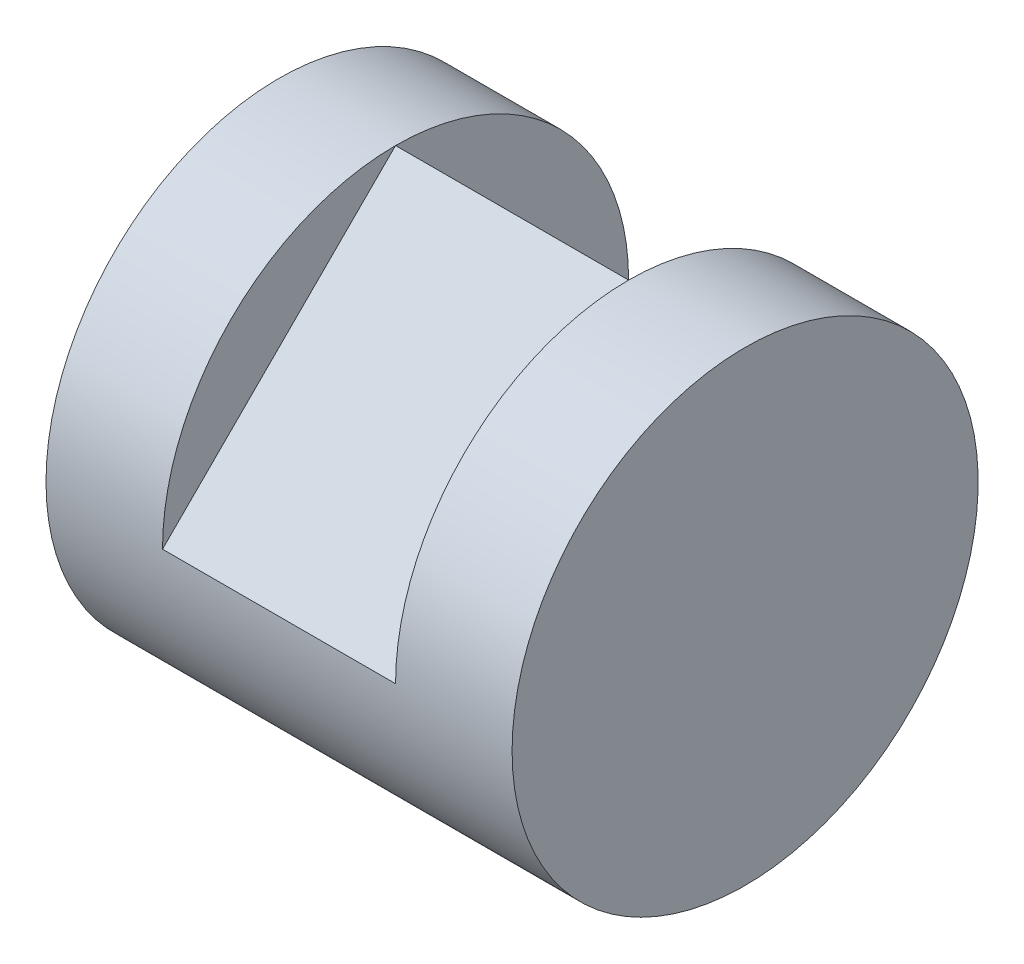
ISO-10303-21;
HEADER;
FILE_DESCRIPTION(('STEP AP214'),'2;1');
FILE_NAME('part.step','',(''),(''),'','','');
FILE_SCHEMA(('AUTOMOTIVE_DESIGN { 1 0 10303 214 1 1 1 1 }'));
ENDSEC;
DATA;
#1=APPLICATION_CONTEXT('core data for automotive mechanical design processes');
#2=APPLICATION_PROTOCOL_DEFINITION('international standard','automotive_design',2000,#1);
#3=PRODUCT_CONTEXT('',#1,'mechanical');
#4=PRODUCT('Part','Part','',(#3));
#5=PRODUCT_RELATED_PRODUCT_CATEGORY('part','',(#4));
#6=PRODUCT_DEFINITION_FORMATION('','',#4);
#7=PRODUCT_DEFINITION_CONTEXT('part definition',#1,'design');
#8=PRODUCT_DEFINITION('design','',#6,#7);
#9=PRODUCT_DEFINITION_SHAPE('','',#8);
#10=(LENGTH_UNIT() NAMED_UNIT(*) SI_UNIT(.MILLI.,.METRE.));
#11=(NAMED_UNIT(*) PLANE_ANGLE_UNIT() SI_UNIT($,.RADIAN.));
#12=(NAMED_UNIT(*) SI_UNIT($,.STERADIAN.) SOLID_ANGLE_UNIT());
#13=UNCERTAINTY_MEASURE_WITH_UNIT(LENGTH_MEASURE(1.E-05),#10,'distance_accuracy_value','');
#14=(GEOMETRIC_REPRESENTATION_CONTEXT(3) GLOBAL_UNCERTAINTY_ASSIGNED_CONTEXT((#13)) GLOBAL_UNIT_ASSIGNED_CONTEXT((#10,
#11,#12)) REPRESENTATION_CONTEXT('',''));
#15=CARTESIAN_POINT('',(0.,0.,0.));
#16=DIRECTION('',(0.,0.,1.));
#17=DIRECTION('',(1.,0.,0.));
#18=AXIS2_PLACEMENT_3D('',#15,#16,#17);
#19=CARTESIAN_POINT('',(10.,40.,71.));
#20=DIRECTION('',(1.,0.,0.));
#21=DIRECTION('',(0.,1.,0.));
#22=AXIS2_PLACEMENT_3D('',#19,#20,#21);
#23=PLANE('',#22);
#24=CARTESIAN_POINT('',(10.,20.,20.));
#25=DIRECTION('',(1.,0.,0.));
#26=DIRECTION('',(0.,1.,0.));
#27=AXIS2_PLACEMENT_3D('',#24,#25,#26);
#28=CIRCLE('',#27,20.);
#29=CARTESIAN_POINT('',(10.,20.,40.));
#30=VERTEX_POINT('',#29);
#31=CARTESIAN_POINT('',(10.,40.,20.));
#32=VERTEX_POINT('',#31);
#33=EDGE_CURVE('E115',#30,#32,#28,.F.);
#34=ORIENTED_EDGE('',*,*,#33,.F.);
#35=DIRECTION('',(0.,-0.707106781186547,0.707106781186548));
#36=VECTOR('',#35,1.);
#37=CARTESIAN_POINT('',(10.,30.,30.));
#38=LINE('',#37,#36);
#39=EDGE_CURVE('E138',#32,#30,#38,.T.);
#40=ORIENTED_EDGE('',*,*,#39,.F.);
#41=EDGE_LOOP('',(#34,#40));
#42=FACE_BOUND('',#41,.T.);
#43=ADVANCED_FACE('F107',(#42),#23,.T.);
#44=CARTESIAN_POINT('',(30.,40.,71.));
#45=DIRECTION('',(-1.,0.,0.));
#46=DIRECTION('',(0.,0.,1.));
#47=AXIS2_PLACEMENT_3D('',#44,#45,#46);
#48=PLANE('',#47);
#49=CARTESIAN_POINT('',(30.,20.,20.));
#50=DIRECTION('',(-1.,0.,0.));
#51=DIRECTION('',(0.,0.,1.));
#52=AXIS2_PLACEMENT_3D('',#49,#50,#51);
#53=CIRCLE('',#52,20.);
#54=CARTESIAN_POINT('',(30.,40.,20.));
#55=VERTEX_POINT('',#54);
#56=CARTESIAN_POINT('',(30.,20.,40.));
#57=VERTEX_POINT('',#56);
#58=EDGE_CURVE('E154',#55,#57,#53,.F.);
#59=ORIENTED_EDGE('',*,*,#58,.F.);
#60=DIRECTION('',(0.,-0.707106781186547,0.707106781186548));
#61=VECTOR('',#60,1.);
#62=CARTESIAN_POINT('',(30.,30.,30.));
#63=LINE('',#62,#61);
#64=EDGE_CURVE('E169',#55,#57,#63,.T.);
#65=ORIENTED_EDGE('',*,*,#64,.T.);
#66=EDGE_LOOP('',(#59,#65));
#67=FACE_BOUND('',#66,.T.);
#68=ADVANCED_FACE('F188',(#67),#48,.T.);
#69=CARTESIAN_POINT('',(71.,20.,20.));
#70=DIRECTION('',(-1.,0.,0.));
#71=DIRECTION('',(0.,0.,1.));
#72=AXIS2_PLACEMENT_3D('',#69,#70,#71);
#73=CYLINDRICAL_SURFACE('',#72,20.);
#74=CARTESIAN_POINT('',(0.,20.,20.));
#75=DIRECTION('',(-1.,0.,0.));
#76=DIRECTION('',(0.,0.,1.));
#77=AXIS2_PLACEMENT_3D('',#74,#75,#76);
#78=CIRCLE('',#77,20.);
#79=CARTESIAN_POINT('',(0.,20.,40.));
#80=VERTEX_POINT('',#79);
#81=EDGE_CURVE('E162',#80,#80,#78,.T.);
#82=ORIENTED_EDGE('',*,*,#81,.F.);
#83=EDGE_LOOP('',(#82));
#84=FACE_BOUND('',#83,.T.);
#85=CARTESIAN_POINT('',(40.,20.,20.));
#86=DIRECTION('',(-1.,0.,0.));
#87=DIRECTION('',(0.,0.,1.));
#88=AXIS2_PLACEMENT_3D('',#85,#86,#87);
#89=CIRCLE('',#88,20.);
#90=CARTESIAN_POINT('',(40.,20.,40.));
#91=VERTEX_POINT('',#90);
#92=EDGE_CURVE('E159',#91,#91,#89,.T.);
#93=ORIENTED_EDGE('',*,*,#92,.T.);
#94=EDGE_LOOP('',(#93));
#95=FACE_BOUND('',#94,.T.);
#96=ORIENTED_EDGE('',*,*,#33,.T.);
#97=CARTESIAN_POINT('',(10.,20.,0.));
#98=VERTEX_POINT('',#97);
#99=EDGE_CURVE('E149',#32,#98,#28,.F.);
#100=ORIENTED_EDGE('',*,*,#99,.T.);
#101=DIRECTION('',(1.,0.,0.));
#102=VECTOR('',#101,1.);
#103=CARTESIAN_POINT('',(10.,20.,0.));
#104=LINE('',#103,#102);
#105=CARTESIAN_POINT('',(30.,20.,0.));
#106=VERTEX_POINT('',#105);
#107=EDGE_CURVE('E167',#98,#106,#104,.T.);
#108=ORIENTED_EDGE('',*,*,#107,.T.);
#109=EDGE_CURVE('E157',#106,#55,#53,.F.);
#110=ORIENTED_EDGE('',*,*,#109,.T.);
#111=ORIENTED_EDGE('',*,*,#58,.T.);
#112=DIRECTION('',(-1.,0.,0.));
#113=VECTOR('',#112,1.);
#114=CARTESIAN_POINT('',(71.,20.,40.));
#115=LINE('',#114,#113);
#116=EDGE_CURVE('E12',#57,#30,#115,.T.);
#117=ORIENTED_EDGE('',*,*,#116,.T.);
#118=EDGE_LOOP('',(#96,#100,#108,#110,#111,#117));
#119=FACE_BOUND('',#118,.T.);
#120=ADVANCED_FACE('F151',(#84,#95,#119),#73,.T.);
#121=CARTESIAN_POINT('',(0.,0.,40.));
#122=DIRECTION('',(1.,0.,0.));
#123=DIRECTION('',(0.,0.,-1.));
#124=AXIS2_PLACEMENT_3D('',#121,#122,#123);
#125=PLANE('',#124);
#126=ORIENTED_EDGE('',*,*,#81,.T.);
#127=EDGE_LOOP('',(#126));
#128=FACE_BOUND('',#127,.T.);
#129=ADVANCED_FACE('F109',(#128),#125,.F.);
#130=CARTESIAN_POINT('',(40.,0.,40.));
#131=DIRECTION('',(-1.,0.,0.));
#132=DIRECTION('',(0.,0.,1.));
#133=AXIS2_PLACEMENT_3D('',#130,#131,#132);
#134=PLANE('',#133);
#135=ORIENTED_EDGE('',*,*,#92,.F.);
#136=EDGE_LOOP('',(#135));
#137=FACE_BOUND('',#136,.T.);
#138=ADVANCED_FACE('F181',(#137),#134,.F.);
#139=DIRECTION('',(0.,-0.707106781186548,-0.707106781186548));
#140=VECTOR('',#139,1.);
#141=CARTESIAN_POINT('',(10.,10.,-10.));
#142=LINE('',#141,#140);
#143=EDGE_CURVE('E144',#32,#98,#142,.T.);
#144=ORIENTED_EDGE('',*,*,#143,.T.);
#145=ORIENTED_EDGE('',*,*,#99,.F.);
#146=EDGE_LOOP('',(#144,#145));
#147=FACE_BOUND('',#146,.T.);
#148=ADVANCED_FACE('F179',(#147),#23,.T.);
#149=DIRECTION('',(0.,-0.707106781186548,-0.707106781186548));
#150=VECTOR('',#149,1.);
#151=CARTESIAN_POINT('',(30.,9.99999999999999,-10.));
#152=LINE('',#151,#150);
#153=EDGE_CURVE('E143',#55,#106,#152,.T.);
#154=ORIENTED_EDGE('',*,*,#153,.F.);
#155=ORIENTED_EDGE('',*,*,#109,.F.);
#156=EDGE_LOOP('',(#154,#155));
#157=FACE_BOUND('',#156,.T.);
#158=ADVANCED_FACE('F177',(#157),#48,.T.);
#159=CARTESIAN_POINT('',(30.,9.99999999999999,-10.));
#160=DIRECTION('',(0.,0.707106781186548,-0.707106781186548));
#161=DIRECTION('',(0.,0.707106781186548,0.707106781186548));
#162=AXIS2_PLACEMENT_3D('',#159,#160,#161);
#163=PLANE('',#162);
#164=ORIENTED_EDGE('',*,*,#143,.F.);
#165=DIRECTION('',(-1.,0.,0.));
#166=VECTOR('',#165,1.);
#167=CARTESIAN_POINT('',(30.,40.,20.));
#168=LINE('',#167,#166);
#169=EDGE_CURVE('E129',#55,#32,#168,.T.);
#170=ORIENTED_EDGE('',*,*,#169,.F.);
#171=ORIENTED_EDGE('',*,*,#153,.T.);
#172=ORIENTED_EDGE('',*,*,#107,.F.);
#173=EDGE_LOOP('',(#164,#170,#171,#172));
#174=FACE_BOUND('',#173,.T.);
#175=ADVANCED_FACE('F175',(#174),#163,.T.);
#176=CARTESIAN_POINT('',(30.,30.,30.));
#177=DIRECTION('',(0.,-0.707106781186548,-0.707106781186547));
#178=DIRECTION('',(0.,0.707106781186547,-0.707106781186548));
#179=AXIS2_PLACEMENT_3D('',#176,#177,#178);
#180=PLANE('',#179);
#181=ORIENTED_EDGE('',*,*,#39,.T.);
#182=ORIENTED_EDGE('',*,*,#116,.F.);
#183=ORIENTED_EDGE('',*,*,#64,.F.);
#184=ORIENTED_EDGE('',*,*,#169,.T.);
#185=EDGE_LOOP('',(#181,#182,#183,#184));
#186=FACE_BOUND('',#185,.T.);
#187=ADVANCED_FACE('F140',(#186),#180,.F.);
#188=CLOSED_SHELL('',(#43,#68,#120,#129,#138,#148,#158,#175,#187));
#189=MANIFOLD_SOLID_BREP('B2',#188);
#190=ADVANCED_BREP_SHAPE_REPRESENTATION('',(#18,#189),#14);
#191=SHAPE_DEFINITION_REPRESENTATION(#9,#190);
ENDSEC;
END-ISO-10303-21;
